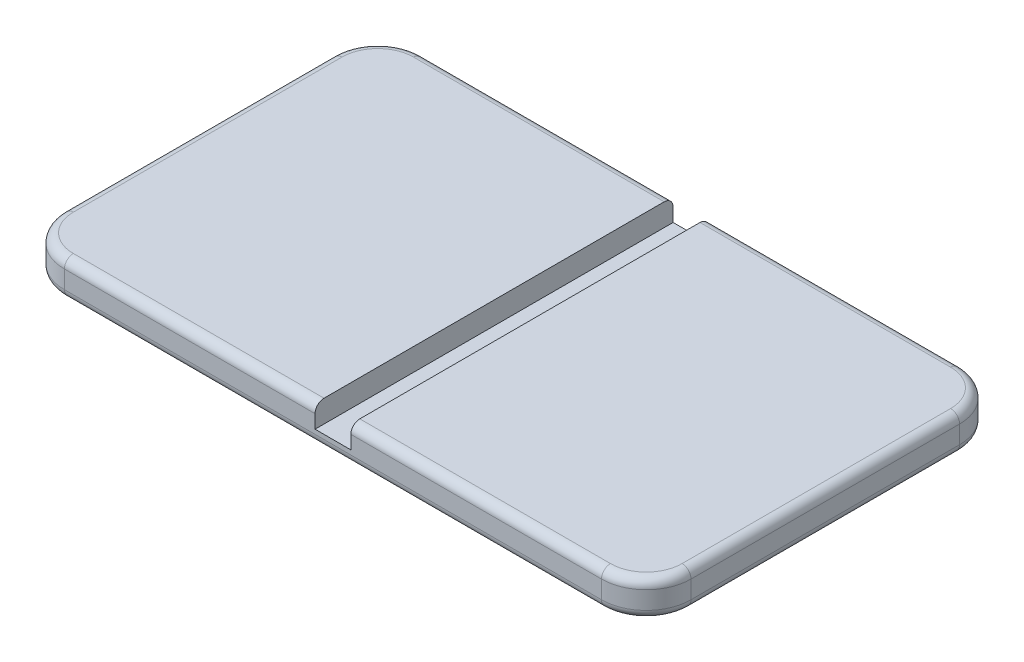
ISO-10303-21;
HEADER;
FILE_DESCRIPTION(('STEP AP214'),'2;1');
FILE_NAME('part.step','',(''),(''),'','','');
FILE_SCHEMA(('AUTOMOTIVE_DESIGN { 1 0 10303 214 1 1 1 1 }'));
ENDSEC;
DATA;
#1=APPLICATION_CONTEXT('core data for automotive mechanical design processes');
#2=APPLICATION_PROTOCOL_DEFINITION('international standard','automotive_design',2000,#1);
#3=PRODUCT_CONTEXT('',#1,'mechanical');
#4=PRODUCT('Part','Part','',(#3));
#5=PRODUCT_RELATED_PRODUCT_CATEGORY('part','',(#4));
#6=PRODUCT_DEFINITION_FORMATION('','',#4);
#7=PRODUCT_DEFINITION_CONTEXT('part definition',#1,'design');
#8=PRODUCT_DEFINITION('design','',#6,#7);
#9=PRODUCT_DEFINITION_SHAPE('','',#8);
#10=(LENGTH_UNIT() NAMED_UNIT(*) SI_UNIT(.MILLI.,.METRE.));
#11=(NAMED_UNIT(*) PLANE_ANGLE_UNIT() SI_UNIT($,.RADIAN.));
#12=(NAMED_UNIT(*) SI_UNIT($,.STERADIAN.) SOLID_ANGLE_UNIT());
#13=UNCERTAINTY_MEASURE_WITH_UNIT(LENGTH_MEASURE(1.E-05),#10,'distance_accuracy_value','');
#14=(GEOMETRIC_REPRESENTATION_CONTEXT(3) GLOBAL_UNCERTAINTY_ASSIGNED_CONTEXT((#13)) GLOBAL_UNIT_ASSIGNED_CONTEXT((#10,
#11,#12)) REPRESENTATION_CONTEXT('',''));
#15=CARTESIAN_POINT('',(0.,0.,0.));
#16=DIRECTION('',(0.,0.,1.));
#17=DIRECTION('',(1.,0.,0.));
#18=AXIS2_PLACEMENT_3D('',#15,#16,#17);
#19=CARTESIAN_POINT('',(0.,8.,0.));
#20=DIRECTION('',(0.,-1.,0.));
#21=DIRECTION('',(0.,0.,-1.));
#22=AXIS2_PLACEMENT_3D('',#19,#20,#21);
#23=PLANE('',#22);
#24=CARTESIAN_POINT('',(10.,8.,-10.));
#25=DIRECTION('',(0.,-1.,0.));
#26=DIRECTION('',(0.,0.,-1.));
#27=AXIS2_PLACEMENT_3D('',#24,#25,#26);
#28=CIRCLE('',#27,8.);
#29=CARTESIAN_POINT('',(2.,8.,-10.));
#30=VERTEX_POINT('',#29);
#31=CARTESIAN_POINT('',(10.,8.,-2.));
#32=VERTEX_POINT('',#31);
#33=EDGE_CURVE('E312',#30,#32,#28,.F.);
#34=ORIENTED_EDGE('',*,*,#33,.T.);
#35=DIRECTION('',(1.,0.,0.));
#36=VECTOR('',#35,1.);
#37=CARTESIAN_POINT('',(0.,8.,-2.));
#38=LINE('',#37,#36);
#39=CARTESIAN_POINT('',(66.,8.,-2.));
#40=VERTEX_POINT('',#39);
#41=EDGE_CURVE('E314',#32,#40,#38,.T.);
#42=ORIENTED_EDGE('',*,*,#41,.T.);
#43=DIRECTION('',(0.,0.,1.));
#44=VECTOR('',#43,1.);
#45=CARTESIAN_POINT('',(66.,8.,-80.001));
#46=LINE('',#45,#44);
#47=CARTESIAN_POINT('',(66.,8.,-78.));
#48=VERTEX_POINT('',#47);
#49=EDGE_CURVE('E211',#48,#40,#46,.T.);
#50=ORIENTED_EDGE('',*,*,#49,.F.);
#51=DIRECTION('',(-1.,0.,0.));
#52=VECTOR('',#51,1.);
#53=CARTESIAN_POINT('',(0.,8.,-78.));
#54=LINE('',#53,#52);
#55=CARTESIAN_POINT('',(10.,8.,-78.));
#56=VERTEX_POINT('',#55);
#57=EDGE_CURVE('E306',#48,#56,#54,.T.);
#58=ORIENTED_EDGE('',*,*,#57,.T.);
#59=CARTESIAN_POINT('',(10.,8.,-70.));
#60=DIRECTION('',(0.,-1.,0.));
#61=DIRECTION('',(0.,0.,-1.));
#62=AXIS2_PLACEMENT_3D('',#59,#60,#61);
#63=CIRCLE('',#62,8.);
#64=CARTESIAN_POINT('',(2.,8.,-70.));
#65=VERTEX_POINT('',#64);
#66=EDGE_CURVE('E308',#56,#65,#63,.F.);
#67=ORIENTED_EDGE('',*,*,#66,.T.);
#68=DIRECTION('',(0.,0.,1.));
#69=VECTOR('',#68,1.);
#70=CARTESIAN_POINT('',(2.,8.,0.));
#71=LINE('',#70,#69);
#72=EDGE_CURVE('E310',#65,#30,#71,.T.);
#73=ORIENTED_EDGE('',*,*,#72,.T.);
#74=EDGE_LOOP('',(#34,#42,#50,#58,#67,#73));
#75=FACE_BOUND('',#74,.T.);
#76=ADVANCED_FACE('F35',(#75),#23,.F.);
#77=CARTESIAN_POINT('',(0.,8.,0.));
#78=DIRECTION('',(1.,0.,0.));
#79=DIRECTION('',(0.,0.,-1.));
#80=AXIS2_PLACEMENT_3D('',#77,#78,#79);
#81=PLANE('',#80);
#82=DIRECTION('',(0.,-1.,0.));
#83=VECTOR('',#82,1.);
#84=CARTESIAN_POINT('',(0.,8.,-70.));
#85=LINE('',#84,#83);
#86=CARTESIAN_POINT('',(0.,6.,-70.));
#87=VERTEX_POINT('',#86);
#88=CARTESIAN_POINT('',(0.,2.,-70.));
#89=VERTEX_POINT('',#88);
#90=EDGE_CURVE('E234',#87,#89,#85,.T.);
#91=ORIENTED_EDGE('',*,*,#90,.T.);
#92=DIRECTION('',(0.,0.,1.));
#93=VECTOR('',#92,1.);
#94=CARTESIAN_POINT('',(0.,2.,-10.));
#95=LINE('',#94,#93);
#96=CARTESIAN_POINT('',(0.,2.,-10.));
#97=VERTEX_POINT('',#96);
#98=EDGE_CURVE('E304',#89,#97,#95,.T.);
#99=ORIENTED_EDGE('',*,*,#98,.T.);
#100=DIRECTION('',(0.,-1.,0.));
#101=VECTOR('',#100,1.);
#102=CARTESIAN_POINT('',(0.,8.,-10.));
#103=LINE('',#102,#101);
#104=CARTESIAN_POINT('',(0.,6.,-10.));
#105=VERTEX_POINT('',#104);
#106=EDGE_CURVE('E210',#97,#105,#103,.F.);
#107=ORIENTED_EDGE('',*,*,#106,.T.);
#108=DIRECTION('',(0.,0.,1.));
#109=VECTOR('',#108,1.);
#110=CARTESIAN_POINT('',(0.,6.,0.));
#111=LINE('',#110,#109);
#112=EDGE_CURVE('E302',#105,#87,#111,.F.);
#113=ORIENTED_EDGE('',*,*,#112,.T.);
#114=EDGE_LOOP('',(#91,#99,#107,#113));
#115=FACE_BOUND('',#114,.T.);
#116=ADVANCED_FACE('F470',(#115),#81,.F.);
#117=CARTESIAN_POINT('',(0.,8.,0.));
#118=DIRECTION('',(0.,0.,-1.));
#119=DIRECTION('',(-1.,0.,0.));
#120=AXIS2_PLACEMENT_3D('',#117,#118,#119);
#121=PLANE('',#120);
#122=DIRECTION('',(0.,-1.,0.));
#123=VECTOR('',#122,1.);
#124=CARTESIAN_POINT('',(10.,8.,0.));
#125=LINE('',#124,#123);
#126=CARTESIAN_POINT('',(10.,6.,0.));
#127=VERTEX_POINT('',#126);
#128=CARTESIAN_POINT('',(10.,2.,0.));
#129=VERTEX_POINT('',#128);
#130=EDGE_CURVE('E247',#127,#129,#125,.T.);
#131=ORIENTED_EDGE('',*,*,#130,.T.);
#132=DIRECTION('',(1.,0.,0.));
#133=VECTOR('',#132,1.);
#134=CARTESIAN_POINT('',(130.,2.,0.));
#135=LINE('',#134,#133);
#136=CARTESIAN_POINT('',(130.,2.,0.));
#137=VERTEX_POINT('',#136);
#138=EDGE_CURVE('E279',#129,#137,#135,.T.);
#139=ORIENTED_EDGE('',*,*,#138,.T.);
#140=DIRECTION('',(0.,-1.,0.));
#141=VECTOR('',#140,1.);
#142=CARTESIAN_POINT('',(130.,8.,0.));
#143=LINE('',#142,#141);
#144=CARTESIAN_POINT('',(130.,6.,0.));
#145=VERTEX_POINT('',#144);
#146=EDGE_CURVE('E250',#137,#145,#143,.F.);
#147=ORIENTED_EDGE('',*,*,#146,.T.);
#148=DIRECTION('',(1.,0.,0.));
#149=VECTOR('',#148,1.);
#150=CARTESIAN_POINT('',(0.,6.,0.));
#151=LINE('',#150,#149);
#152=CARTESIAN_POINT('',(74.,6.,0.));
#153=VERTEX_POINT('',#152);
#154=EDGE_CURVE('E275',#145,#153,#151,.F.);
#155=ORIENTED_EDGE('',*,*,#154,.T.);
#156=DIRECTION('',(0.,1.,0.));
#157=VECTOR('',#156,1.);
#158=CARTESIAN_POINT('',(74.,8.,0.));
#159=LINE('',#158,#157);
#160=CARTESIAN_POINT('',(74.,3.,0.));
#161=VERTEX_POINT('',#160);
#162=EDGE_CURVE('E202',#161,#153,#159,.T.);
#163=ORIENTED_EDGE('',*,*,#162,.F.);
#164=DIRECTION('',(1.,0.,0.));
#165=VECTOR('',#164,1.);
#166=CARTESIAN_POINT('',(66.,3.,0.));
#167=LINE('',#166,#165);
#168=CARTESIAN_POINT('',(66.,3.,0.));
#169=VERTEX_POINT('',#168);
#170=EDGE_CURVE('E220',#169,#161,#167,.T.);
#171=ORIENTED_EDGE('',*,*,#170,.F.);
#172=DIRECTION('',(0.,-1.,0.));
#173=VECTOR('',#172,1.);
#174=CARTESIAN_POINT('',(66.,8.,0.));
#175=LINE('',#174,#173);
#176=CARTESIAN_POINT('',(66.,6.,0.));
#177=VERTEX_POINT('',#176);
#178=EDGE_CURVE('E197',#177,#169,#175,.T.);
#179=ORIENTED_EDGE('',*,*,#178,.F.);
#180=DIRECTION('',(1.,0.,0.));
#181=VECTOR('',#180,1.);
#182=CARTESIAN_POINT('',(0.,6.,0.));
#183=LINE('',#182,#181);
#184=EDGE_CURVE('E277',#177,#127,#183,.F.);
#185=ORIENTED_EDGE('',*,*,#184,.T.);
#186=EDGE_LOOP('',(#131,#139,#147,#155,#163,#171,#179,#185));
#187=FACE_BOUND('',#186,.T.);
#188=ADVANCED_FACE('F459',(#187),#121,.F.);
#189=CARTESIAN_POINT('',(140.,8.,0.));
#190=DIRECTION('',(-1.,0.,0.));
#191=DIRECTION('',(0.,0.,1.));
#192=AXIS2_PLACEMENT_3D('',#189,#190,#191);
#193=PLANE('',#192);
#194=DIRECTION('',(0.,-1.,0.));
#195=VECTOR('',#194,1.);
#196=CARTESIAN_POINT('',(140.,8.,-10.));
#197=LINE('',#196,#195);
#198=CARTESIAN_POINT('',(140.,6.,-10.));
#199=VERTEX_POINT('',#198);
#200=CARTESIAN_POINT('',(140.,2.,-10.));
#201=VERTEX_POINT('',#200);
#202=EDGE_CURVE('E241',#199,#201,#197,.T.);
#203=ORIENTED_EDGE('',*,*,#202,.T.);
#204=DIRECTION('',(0.,0.,-1.));
#205=VECTOR('',#204,1.);
#206=CARTESIAN_POINT('',(140.,2.,-70.));
#207=LINE('',#206,#205);
#208=CARTESIAN_POINT('',(140.,2.,-70.));
#209=VERTEX_POINT('',#208);
#210=EDGE_CURVE('E287',#201,#209,#207,.T.);
#211=ORIENTED_EDGE('',*,*,#210,.T.);
#212=DIRECTION('',(0.,-1.,0.));
#213=VECTOR('',#212,1.);
#214=CARTESIAN_POINT('',(140.,8.,-70.));
#215=LINE('',#214,#213);
#216=CARTESIAN_POINT('',(140.,6.,-70.));
#217=VERTEX_POINT('',#216);
#218=EDGE_CURVE('E244',#209,#217,#215,.F.);
#219=ORIENTED_EDGE('',*,*,#218,.T.);
#220=DIRECTION('',(0.,0.,-1.));
#221=VECTOR('',#220,1.);
#222=CARTESIAN_POINT('',(140.,6.,0.));
#223=LINE('',#222,#221);
#224=EDGE_CURVE('E285',#217,#199,#223,.F.);
#225=ORIENTED_EDGE('',*,*,#224,.T.);
#226=EDGE_LOOP('',(#203,#211,#219,#225));
#227=FACE_BOUND('',#226,.T.);
#228=ADVANCED_FACE('F395',(#227),#193,.F.);
#229=CARTESIAN_POINT('',(0.,8.,-80.));
#230=DIRECTION('',(0.,0.,1.));
#231=DIRECTION('',(1.,0.,0.));
#232=AXIS2_PLACEMENT_3D('',#229,#230,#231);
#233=PLANE('',#232);
#234=DIRECTION('',(0.,-1.,0.));
#235=VECTOR('',#234,1.);
#236=CARTESIAN_POINT('',(130.,8.,-80.));
#237=LINE('',#236,#235);
#238=CARTESIAN_POINT('',(130.,6.,-80.));
#239=VERTEX_POINT('',#238);
#240=CARTESIAN_POINT('',(130.,2.,-80.));
#241=VERTEX_POINT('',#240);
#242=EDGE_CURVE('E237',#239,#241,#237,.T.);
#243=ORIENTED_EDGE('',*,*,#242,.T.);
#244=DIRECTION('',(-1.,0.,0.));
#245=VECTOR('',#244,1.);
#246=CARTESIAN_POINT('',(10.,2.,-80.));
#247=LINE('',#246,#245);
#248=CARTESIAN_POINT('',(10.,2.,-80.));
#249=VERTEX_POINT('',#248);
#250=EDGE_CURVE('E296',#241,#249,#247,.T.);
#251=ORIENTED_EDGE('',*,*,#250,.T.);
#252=DIRECTION('',(0.,-1.,0.));
#253=VECTOR('',#252,1.);
#254=CARTESIAN_POINT('',(10.,8.,-80.));
#255=LINE('',#254,#253);
#256=CARTESIAN_POINT('',(10.,6.,-80.));
#257=VERTEX_POINT('',#256);
#258=EDGE_CURVE('E239',#249,#257,#255,.F.);
#259=ORIENTED_EDGE('',*,*,#258,.T.);
#260=DIRECTION('',(-1.,0.,0.));
#261=VECTOR('',#260,1.);
#262=CARTESIAN_POINT('',(0.,6.,-80.));
#263=LINE('',#262,#261);
#264=CARTESIAN_POINT('',(66.,6.,-80.));
#265=VERTEX_POINT('',#264);
#266=EDGE_CURVE('E217',#257,#265,#263,.F.);
#267=ORIENTED_EDGE('',*,*,#266,.T.);
#268=DIRECTION('',(0.,1.,0.));
#269=VECTOR('',#268,1.);
#270=CARTESIAN_POINT('',(66.,8.,-80.));
#271=LINE('',#270,#269);
#272=CARTESIAN_POINT('',(66.,3.,-80.));
#273=VERTEX_POINT('',#272);
#274=EDGE_CURVE('E194',#273,#265,#271,.T.);
#275=ORIENTED_EDGE('',*,*,#274,.F.);
#276=DIRECTION('',(-1.,0.,0.));
#277=VECTOR('',#276,1.);
#278=CARTESIAN_POINT('',(66.,3.,-80.));
#279=LINE('',#278,#277);
#280=CARTESIAN_POINT('',(74.,3.,-80.));
#281=VERTEX_POINT('',#280);
#282=EDGE_CURVE('E206',#281,#273,#279,.T.);
#283=ORIENTED_EDGE('',*,*,#282,.F.);
#284=DIRECTION('',(0.,-1.,0.));
#285=VECTOR('',#284,1.);
#286=CARTESIAN_POINT('',(74.,8.,-80.));
#287=LINE('',#286,#285);
#288=CARTESIAN_POINT('',(74.,6.,-80.));
#289=VERTEX_POINT('',#288);
#290=EDGE_CURVE('E218',#289,#281,#287,.T.);
#291=ORIENTED_EDGE('',*,*,#290,.F.);
#292=DIRECTION('',(-1.,0.,0.));
#293=VECTOR('',#292,1.);
#294=CARTESIAN_POINT('',(0.,6.,-80.));
#295=LINE('',#294,#293);
#296=EDGE_CURVE('E293',#289,#239,#295,.F.);
#297=ORIENTED_EDGE('',*,*,#296,.T.);
#298=EDGE_LOOP('',(#243,#251,#259,#267,#275,#283,#291,#297));
#299=FACE_BOUND('',#298,.T.);
#300=ADVANCED_FACE('F214',(#299),#233,.F.);
#301=DIRECTION('',(0.,0.,1.));
#302=VECTOR('',#301,1.);
#303=CARTESIAN_POINT('',(74.,8.,-80.001));
#304=LINE('',#303,#302);
#305=CARTESIAN_POINT('',(74.,8.,-78.));
#306=VERTEX_POINT('',#305);
#307=CARTESIAN_POINT('',(74.,8.,-2.));
#308=VERTEX_POINT('',#307);
#309=EDGE_CURVE('E229',#306,#308,#304,.T.);
#310=ORIENTED_EDGE('',*,*,#309,.T.);
#311=DIRECTION('',(1.,0.,0.));
#312=VECTOR('',#311,1.);
#313=CARTESIAN_POINT('',(0.,8.,-2.));
#314=LINE('',#313,#312);
#315=CARTESIAN_POINT('',(130.,8.,-2.));
#316=VERTEX_POINT('',#315);
#317=EDGE_CURVE('E52',#308,#316,#314,.T.);
#318=ORIENTED_EDGE('',*,*,#317,.T.);
#319=CARTESIAN_POINT('',(130.,8.,-10.));
#320=DIRECTION('',(0.,-1.,0.));
#321=DIRECTION('',(0.,0.,-1.));
#322=AXIS2_PLACEMENT_3D('',#319,#320,#321);
#323=CIRCLE('',#322,8.);
#324=CARTESIAN_POINT('',(138.,8.,-10.));
#325=VERTEX_POINT('',#324);
#326=EDGE_CURVE('E327',#316,#325,#323,.F.);
#327=ORIENTED_EDGE('',*,*,#326,.T.);
#328=DIRECTION('',(0.,0.,-1.));
#329=VECTOR('',#328,1.);
#330=CARTESIAN_POINT('',(138.,8.,0.));
#331=LINE('',#330,#329);
#332=CARTESIAN_POINT('',(138.,8.,-70.));
#333=VERTEX_POINT('',#332);
#334=EDGE_CURVE('E325',#325,#333,#331,.T.);
#335=ORIENTED_EDGE('',*,*,#334,.T.);
#336=CARTESIAN_POINT('',(130.,8.,-70.));
#337=DIRECTION('',(0.,-1.,0.));
#338=DIRECTION('',(0.,0.,-1.));
#339=AXIS2_PLACEMENT_3D('',#336,#337,#338);
#340=CIRCLE('',#339,8.);
#341=CARTESIAN_POINT('',(130.,8.,-78.));
#342=VERTEX_POINT('',#341);
#343=EDGE_CURVE('E323',#333,#342,#340,.F.);
#344=ORIENTED_EDGE('',*,*,#343,.T.);
#345=DIRECTION('',(-1.,0.,0.));
#346=VECTOR('',#345,1.);
#347=CARTESIAN_POINT('',(0.,8.,-78.));
#348=LINE('',#347,#346);
#349=EDGE_CURVE('E321',#342,#306,#348,.T.);
#350=ORIENTED_EDGE('',*,*,#349,.T.);
#351=EDGE_LOOP('',(#310,#318,#327,#335,#344,#350));
#352=FACE_BOUND('',#351,.T.);
#353=ADVANCED_FACE('F383',(#352),#23,.F.);
#354=CARTESIAN_POINT('',(0.,0.,0.));
#355=DIRECTION('',(0.,-1.,0.));
#356=DIRECTION('',(0.,0.,-1.));
#357=AXIS2_PLACEMENT_3D('',#354,#355,#356);
#358=PLANE('',#357);
#359=DIRECTION('',(1.,0.,0.));
#360=VECTOR('',#359,1.);
#361=CARTESIAN_POINT('',(10.,0.,-2.));
#362=LINE('',#361,#360);
#363=CARTESIAN_POINT('',(130.,0.,-2.));
#364=VERTEX_POINT('',#363);
#365=CARTESIAN_POINT('',(10.,0.,-2.));
#366=VERTEX_POINT('',#365);
#367=EDGE_CURVE('E265',#364,#366,#362,.F.);
#368=ORIENTED_EDGE('',*,*,#367,.T.);
#369=CARTESIAN_POINT('',(10.,0.,-10.));
#370=DIRECTION('',(0.,-1.,0.));
#371=DIRECTION('',(0.,0.,-1.));
#372=AXIS2_PLACEMENT_3D('',#369,#370,#371);
#373=CIRCLE('',#372,8.);
#374=CARTESIAN_POINT('',(2.,0.,-10.));
#375=VERTEX_POINT('',#374);
#376=EDGE_CURVE('E267',#366,#375,#373,.T.);
#377=ORIENTED_EDGE('',*,*,#376,.T.);
#378=DIRECTION('',(0.,0.,1.));
#379=VECTOR('',#378,1.);
#380=CARTESIAN_POINT('',(2.,0.,-70.));
#381=LINE('',#380,#379);
#382=CARTESIAN_POINT('',(2.,0.,-70.));
#383=VERTEX_POINT('',#382);
#384=EDGE_CURVE('E253',#375,#383,#381,.F.);
#385=ORIENTED_EDGE('',*,*,#384,.T.);
#386=CARTESIAN_POINT('',(10.,0.,-70.));
#387=DIRECTION('',(0.,-1.,0.));
#388=DIRECTION('',(0.,0.,-1.));
#389=AXIS2_PLACEMENT_3D('',#386,#387,#388);
#390=CIRCLE('',#389,8.);
#391=CARTESIAN_POINT('',(10.,0.,-78.));
#392=VERTEX_POINT('',#391);
#393=EDGE_CURVE('E255',#383,#392,#390,.T.);
#394=ORIENTED_EDGE('',*,*,#393,.T.);
#395=DIRECTION('',(-1.,0.,0.));
#396=VECTOR('',#395,1.);
#397=CARTESIAN_POINT('',(130.,0.,-78.));
#398=LINE('',#397,#396);
#399=CARTESIAN_POINT('',(130.,0.,-78.));
#400=VERTEX_POINT('',#399);
#401=EDGE_CURVE('E257',#392,#400,#398,.F.);
#402=ORIENTED_EDGE('',*,*,#401,.T.);
#403=CARTESIAN_POINT('',(130.,0.,-70.));
#404=DIRECTION('',(0.,-1.,0.));
#405=DIRECTION('',(0.,0.,-1.));
#406=AXIS2_PLACEMENT_3D('',#403,#404,#405);
#407=CIRCLE('',#406,8.);
#408=CARTESIAN_POINT('',(138.,0.,-70.));
#409=VERTEX_POINT('',#408);
#410=EDGE_CURVE('E259',#400,#409,#407,.T.);
#411=ORIENTED_EDGE('',*,*,#410,.T.);
#412=DIRECTION('',(0.,0.,-1.));
#413=VECTOR('',#412,1.);
#414=CARTESIAN_POINT('',(138.,0.,-10.));
#415=LINE('',#414,#413);
#416=CARTESIAN_POINT('',(138.,0.,-10.));
#417=VERTEX_POINT('',#416);
#418=EDGE_CURVE('E261',#409,#417,#415,.F.);
#419=ORIENTED_EDGE('',*,*,#418,.T.);
#420=CARTESIAN_POINT('',(130.,0.,-10.));
#421=DIRECTION('',(0.,-1.,0.));
#422=DIRECTION('',(0.,0.,-1.));
#423=AXIS2_PLACEMENT_3D('',#420,#421,#422);
#424=CIRCLE('',#423,8.);
#425=EDGE_CURVE('E263',#417,#364,#424,.T.);
#426=ORIENTED_EDGE('',*,*,#425,.T.);
#427=EDGE_LOOP('',(#368,#377,#385,#394,#402,#411,#419,#426));
#428=FACE_BOUND('',#427,.T.);
#429=ADVANCED_FACE('F414',(#428),#358,.T.);
#430=CARTESIAN_POINT('',(66.,8.,-80.001));
#431=DIRECTION('',(-1.,0.,0.));
#432=DIRECTION('',(0.,0.,1.));
#433=AXIS2_PLACEMENT_3D('',#430,#431,#432);
#434=PLANE('',#433);
#435=ORIENTED_EDGE('',*,*,#49,.T.);
#436=CARTESIAN_POINT('',(66.,6.,-2.));
#437=DIRECTION('',(-1.,0.,0.));
#438=DIRECTION('',(0.,0.,1.));
#439=AXIS2_PLACEMENT_3D('',#436,#437,#438);
#440=CIRCLE('',#439,2.);
#441=EDGE_CURVE('E319',#40,#177,#440,.F.);
#442=ORIENTED_EDGE('',*,*,#441,.T.);
#443=ORIENTED_EDGE('',*,*,#178,.T.);
#444=DIRECTION('',(0.,0.,1.));
#445=VECTOR('',#444,1.);
#446=CARTESIAN_POINT('',(66.,3.,-80.001));
#447=LINE('',#446,#445);
#448=EDGE_CURVE('E189',#273,#169,#447,.T.);
#449=ORIENTED_EDGE('',*,*,#448,.F.);
#450=ORIENTED_EDGE('',*,*,#274,.T.);
#451=CARTESIAN_POINT('',(66.,6.,-78.));
#452=DIRECTION('',(-1.,0.,0.));
#453=DIRECTION('',(0.,0.,1.));
#454=AXIS2_PLACEMENT_3D('',#451,#452,#453);
#455=CIRCLE('',#454,2.);
#456=EDGE_CURVE('E317',#265,#48,#455,.F.);
#457=ORIENTED_EDGE('',*,*,#456,.T.);
#458=EDGE_LOOP('',(#435,#442,#443,#449,#450,#457));
#459=FACE_BOUND('',#458,.T.);
#460=ADVANCED_FACE('F192',(#459),#434,.F.);
#461=CARTESIAN_POINT('',(74.,8.,-80.001));
#462=DIRECTION('',(1.,0.,0.));
#463=DIRECTION('',(0.,0.,-1.));
#464=AXIS2_PLACEMENT_3D('',#461,#462,#463);
#465=PLANE('',#464);
#466=ORIENTED_EDGE('',*,*,#162,.T.);
#467=CARTESIAN_POINT('',(74.,6.,-2.));
#468=DIRECTION('',(1.,0.,0.));
#469=DIRECTION('',(0.,0.,-1.));
#470=AXIS2_PLACEMENT_3D('',#467,#468,#469);
#471=CIRCLE('',#470,2.);
#472=EDGE_CURVE('E11',#153,#308,#471,.F.);
#473=ORIENTED_EDGE('',*,*,#472,.T.);
#474=ORIENTED_EDGE('',*,*,#309,.F.);
#475=CARTESIAN_POINT('',(74.,6.,-78.));
#476=DIRECTION('',(1.,0.,0.));
#477=DIRECTION('',(0.,0.,-1.));
#478=AXIS2_PLACEMENT_3D('',#475,#476,#477);
#479=CIRCLE('',#478,2.);
#480=EDGE_CURVE('E44',#306,#289,#479,.F.);
#481=ORIENTED_EDGE('',*,*,#480,.T.);
#482=ORIENTED_EDGE('',*,*,#290,.T.);
#483=DIRECTION('',(0.,0.,1.));
#484=VECTOR('',#483,1.);
#485=CARTESIAN_POINT('',(74.,3.,-80.001));
#486=LINE('',#485,#484);
#487=EDGE_CURVE('E201',#281,#161,#486,.T.);
#488=ORIENTED_EDGE('',*,*,#487,.T.);
#489=EDGE_LOOP('',(#466,#473,#474,#481,#482,#488));
#490=FACE_BOUND('',#489,.T.);
#491=ADVANCED_FACE('F385',(#490),#465,.F.);
#492=CARTESIAN_POINT('',(66.,3.,-80.001));
#493=DIRECTION('',(0.,-1.,0.));
#494=DIRECTION('',(1.,0.,0.));
#495=AXIS2_PLACEMENT_3D('',#492,#493,#494);
#496=PLANE('',#495);
#497=ORIENTED_EDGE('',*,*,#282,.T.);
#498=ORIENTED_EDGE('',*,*,#448,.T.);
#499=ORIENTED_EDGE('',*,*,#170,.T.);
#500=ORIENTED_EDGE('',*,*,#487,.F.);
#501=EDGE_LOOP('',(#497,#498,#499,#500));
#502=FACE_BOUND('',#501,.T.);
#503=ADVANCED_FACE('F207',(#502),#496,.F.);
#504=CARTESIAN_POINT('',(10.,8.,-70.));
#505=DIRECTION('',(0.,-1.,0.));
#506=DIRECTION('',(0.,0.,-1.));
#507=AXIS2_PLACEMENT_3D('',#504,#505,#506);
#508=CYLINDRICAL_SURFACE('',#507,10.);
#509=ORIENTED_EDGE('',*,*,#258,.F.);
#510=CARTESIAN_POINT('',(10.,2.,-70.));
#511=DIRECTION('',(0.,-1.,0.));
#512=DIRECTION('',(0.,0.,-1.));
#513=AXIS2_PLACEMENT_3D('',#510,#511,#512);
#514=CIRCLE('',#513,10.);
#515=EDGE_CURVE('E300',#249,#89,#514,.F.);
#516=ORIENTED_EDGE('',*,*,#515,.T.);
#517=ORIENTED_EDGE('',*,*,#90,.F.);
#518=CARTESIAN_POINT('',(10.,6.,-70.));
#519=DIRECTION('',(0.,-1.,0.));
#520=DIRECTION('',(0.,0.,-1.));
#521=AXIS2_PLACEMENT_3D('',#518,#519,#520);
#522=CIRCLE('',#521,10.);
#523=EDGE_CURVE('E298',#87,#257,#522,.T.);
#524=ORIENTED_EDGE('',*,*,#523,.T.);
#525=EDGE_LOOP('',(#509,#516,#517,#524));
#526=FACE_BOUND('',#525,.T.);
#527=ADVANCED_FACE('F435',(#526),#508,.T.);
#528=CARTESIAN_POINT('',(130.,8.,-70.));
#529=DIRECTION('',(0.,-1.,0.));
#530=DIRECTION('',(0.,0.,-1.));
#531=AXIS2_PLACEMENT_3D('',#528,#529,#530);
#532=CYLINDRICAL_SURFACE('',#531,10.);
#533=ORIENTED_EDGE('',*,*,#218,.F.);
#534=CARTESIAN_POINT('',(130.,2.,-70.));
#535=DIRECTION('',(0.,-1.,0.));
#536=DIRECTION('',(0.,0.,-1.));
#537=AXIS2_PLACEMENT_3D('',#534,#535,#536);
#538=CIRCLE('',#537,10.);
#539=EDGE_CURVE('E291',#209,#241,#538,.F.);
#540=ORIENTED_EDGE('',*,*,#539,.T.);
#541=ORIENTED_EDGE('',*,*,#242,.F.);
#542=CARTESIAN_POINT('',(130.,6.,-70.));
#543=DIRECTION('',(0.,-1.,0.));
#544=DIRECTION('',(0.,0.,-1.));
#545=AXIS2_PLACEMENT_3D('',#542,#543,#544);
#546=CIRCLE('',#545,10.);
#547=EDGE_CURVE('E289',#239,#217,#546,.T.);
#548=ORIENTED_EDGE('',*,*,#547,.T.);
#549=EDGE_LOOP('',(#533,#540,#541,#548));
#550=FACE_BOUND('',#549,.T.);
#551=ADVANCED_FACE('F422',(#550),#532,.T.);
#552=CARTESIAN_POINT('',(130.,8.,-10.));
#553=DIRECTION('',(0.,-1.,0.));
#554=DIRECTION('',(0.,0.,-1.));
#555=AXIS2_PLACEMENT_3D('',#552,#553,#554);
#556=CYLINDRICAL_SURFACE('',#555,10.);
#557=ORIENTED_EDGE('',*,*,#146,.F.);
#558=CARTESIAN_POINT('',(130.,2.,-10.));
#559=DIRECTION('',(0.,-1.,0.));
#560=DIRECTION('',(0.,0.,-1.));
#561=AXIS2_PLACEMENT_3D('',#558,#559,#560);
#562=CIRCLE('',#561,10.);
#563=EDGE_CURVE('E283',#137,#201,#562,.F.);
#564=ORIENTED_EDGE('',*,*,#563,.T.);
#565=ORIENTED_EDGE('',*,*,#202,.F.);
#566=CARTESIAN_POINT('',(130.,6.,-10.));
#567=DIRECTION('',(0.,-1.,0.));
#568=DIRECTION('',(0.,0.,-1.));
#569=AXIS2_PLACEMENT_3D('',#566,#567,#568);
#570=CIRCLE('',#569,10.);
#571=EDGE_CURVE('E281',#199,#145,#570,.T.);
#572=ORIENTED_EDGE('',*,*,#571,.T.);
#573=EDGE_LOOP('',(#557,#564,#565,#572));
#574=FACE_BOUND('',#573,.T.);
#575=ADVANCED_FACE('F400',(#574),#556,.T.);
#576=CARTESIAN_POINT('',(10.,8.,-10.));
#577=DIRECTION('',(0.,-1.,0.));
#578=DIRECTION('',(0.,0.,-1.));
#579=AXIS2_PLACEMENT_3D('',#576,#577,#578);
#580=CYLINDRICAL_SURFACE('',#579,10.);
#581=ORIENTED_EDGE('',*,*,#106,.F.);
#582=CARTESIAN_POINT('',(10.,2.,-10.));
#583=DIRECTION('',(0.,-1.,0.));
#584=DIRECTION('',(0.,0.,-1.));
#585=AXIS2_PLACEMENT_3D('',#582,#583,#584);
#586=CIRCLE('',#585,10.);
#587=EDGE_CURVE('E272',#97,#129,#586,.F.);
#588=ORIENTED_EDGE('',*,*,#587,.T.);
#589=ORIENTED_EDGE('',*,*,#130,.F.);
#590=CARTESIAN_POINT('',(10.,6.,-10.));
#591=DIRECTION('',(0.,-1.,0.));
#592=DIRECTION('',(0.,0.,-1.));
#593=AXIS2_PLACEMENT_3D('',#590,#591,#592);
#594=CIRCLE('',#593,10.);
#595=EDGE_CURVE('E270',#127,#105,#594,.T.);
#596=ORIENTED_EDGE('',*,*,#595,.T.);
#597=EDGE_LOOP('',(#581,#588,#589,#596));
#598=FACE_BOUND('',#597,.T.);
#599=ADVANCED_FACE('F467',(#598),#580,.T.);
#600=CARTESIAN_POINT('',(130.,2.,-70.));
#601=DIRECTION('',(0.,-1.,0.));
#602=DIRECTION('',(0.,0.,-1.));
#603=AXIS2_PLACEMENT_3D('',#600,#601,#602);
#604=TOROIDAL_SURFACE('',#603,8.,2.);
#605=CARTESIAN_POINT('',(130.,2.,-78.));
#606=DIRECTION('',(-1.,0.,0.));
#607=DIRECTION('',(0.,0.,1.));
#608=AXIS2_PLACEMENT_3D('',#605,#606,#607);
#609=CIRCLE('',#608,2.);
#610=EDGE_CURVE('E348',#241,#400,#609,.T.);
#611=ORIENTED_EDGE('',*,*,#610,.F.);
#612=ORIENTED_EDGE('',*,*,#539,.F.);
#613=CARTESIAN_POINT('',(138.,2.,-70.));
#614=DIRECTION('',(0.,0.,1.));
#615=DIRECTION('',(1.,0.,0.));
#616=AXIS2_PLACEMENT_3D('',#613,#614,#615);
#617=CIRCLE('',#616,2.);
#618=EDGE_CURVE('E222',#409,#209,#617,.T.);
#619=ORIENTED_EDGE('',*,*,#618,.F.);
#620=ORIENTED_EDGE('',*,*,#410,.F.);
#621=EDGE_LOOP('',(#611,#612,#619,#620));
#622=FACE_BOUND('',#621,.T.);
#623=ADVANCED_FACE('F426',(#622),#604,.T.);
#624=CARTESIAN_POINT('',(138.,2.,0.));
#625=DIRECTION('',(0.,0.,1.));
#626=DIRECTION('',(1.,0.,0.));
#627=AXIS2_PLACEMENT_3D('',#624,#625,#626);
#628=CYLINDRICAL_SURFACE('',#627,2.);
#629=ORIENTED_EDGE('',*,*,#618,.T.);
#630=ORIENTED_EDGE('',*,*,#210,.F.);
#631=CARTESIAN_POINT('',(138.,2.,-10.));
#632=DIRECTION('',(0.,0.,1.));
#633=DIRECTION('',(1.,0.,0.));
#634=AXIS2_PLACEMENT_3D('',#631,#632,#633);
#635=CIRCLE('',#634,2.);
#636=EDGE_CURVE('E345',#417,#201,#635,.T.);
#637=ORIENTED_EDGE('',*,*,#636,.F.);
#638=ORIENTED_EDGE('',*,*,#418,.F.);
#639=EDGE_LOOP('',(#629,#630,#637,#638));
#640=FACE_BOUND('',#639,.T.);
#641=ADVANCED_FACE('F419',(#640),#628,.T.);
#642=CARTESIAN_POINT('',(0.,2.,-78.));
#643=DIRECTION('',(1.,0.,0.));
#644=DIRECTION('',(0.,0.,-1.));
#645=AXIS2_PLACEMENT_3D('',#642,#643,#644);
#646=CYLINDRICAL_SURFACE('',#645,2.);
#647=ORIENTED_EDGE('',*,*,#610,.T.);
#648=ORIENTED_EDGE('',*,*,#401,.F.);
#649=CARTESIAN_POINT('',(10.,2.,-78.));
#650=DIRECTION('',(-1.,0.,0.));
#651=DIRECTION('',(0.,0.,1.));
#652=AXIS2_PLACEMENT_3D('',#649,#650,#651);
#653=CIRCLE('',#652,2.);
#654=EDGE_CURVE('E342',#249,#392,#653,.T.);
#655=ORIENTED_EDGE('',*,*,#654,.F.);
#656=ORIENTED_EDGE('',*,*,#250,.F.);
#657=EDGE_LOOP('',(#647,#648,#655,#656));
#658=FACE_BOUND('',#657,.T.);
#659=ADVANCED_FACE('F431',(#658),#646,.T.);
#660=CARTESIAN_POINT('',(130.,2.,-10.));
#661=DIRECTION('',(0.,-1.,0.));
#662=DIRECTION('',(0.,0.,-1.));
#663=AXIS2_PLACEMENT_3D('',#660,#661,#662);
#664=TOROIDAL_SURFACE('',#663,8.,2.);
#665=ORIENTED_EDGE('',*,*,#636,.T.);
#666=ORIENTED_EDGE('',*,*,#563,.F.);
#667=CARTESIAN_POINT('',(130.,2.,-2.));
#668=DIRECTION('',(-1.,0.,0.));
#669=DIRECTION('',(0.,0.,1.));
#670=AXIS2_PLACEMENT_3D('',#667,#668,#669);
#671=CIRCLE('',#670,2.);
#672=EDGE_CURVE('E339',#364,#137,#671,.T.);
#673=ORIENTED_EDGE('',*,*,#672,.F.);
#674=ORIENTED_EDGE('',*,*,#425,.F.);
#675=EDGE_LOOP('',(#665,#666,#673,#674));
#676=FACE_BOUND('',#675,.T.);
#677=ADVANCED_FACE('F404',(#676),#664,.T.);
#678=CARTESIAN_POINT('',(10.,2.,-70.));
#679=DIRECTION('',(0.,-1.,0.));
#680=DIRECTION('',(0.,0.,-1.));
#681=AXIS2_PLACEMENT_3D('',#678,#679,#680);
#682=TOROIDAL_SURFACE('',#681,8.,2.);
#683=ORIENTED_EDGE('',*,*,#654,.T.);
#684=ORIENTED_EDGE('',*,*,#393,.F.);
#685=CARTESIAN_POINT('',(2.,2.,-70.));
#686=DIRECTION('',(0.,0.,1.));
#687=DIRECTION('',(1.,0.,0.));
#688=AXIS2_PLACEMENT_3D('',#685,#686,#687);
#689=CIRCLE('',#688,2.);
#690=EDGE_CURVE('E336',#89,#383,#689,.T.);
#691=ORIENTED_EDGE('',*,*,#690,.F.);
#692=ORIENTED_EDGE('',*,*,#515,.F.);
#693=EDGE_LOOP('',(#683,#684,#691,#692));
#694=FACE_BOUND('',#693,.T.);
#695=ADVANCED_FACE('F583',(#694),#682,.T.);
#696=CARTESIAN_POINT('',(0.,2.,-2.));
#697=DIRECTION('',(-1.,0.,0.));
#698=DIRECTION('',(0.,0.,1.));
#699=AXIS2_PLACEMENT_3D('',#696,#697,#698);
#700=CYLINDRICAL_SURFACE('',#699,2.);
#701=ORIENTED_EDGE('',*,*,#672,.T.);
#702=ORIENTED_EDGE('',*,*,#138,.F.);
#703=CARTESIAN_POINT('',(10.,2.,-2.));
#704=DIRECTION('',(-1.,0.,0.));
#705=DIRECTION('',(0.,0.,1.));
#706=AXIS2_PLACEMENT_3D('',#703,#704,#705);
#707=CIRCLE('',#706,2.);
#708=EDGE_CURVE('E333',#366,#129,#707,.T.);
#709=ORIENTED_EDGE('',*,*,#708,.F.);
#710=ORIENTED_EDGE('',*,*,#367,.F.);
#711=EDGE_LOOP('',(#701,#702,#709,#710));
#712=FACE_BOUND('',#711,.T.);
#713=ADVANCED_FACE('F410',(#712),#700,.T.);
#714=CARTESIAN_POINT('',(2.,2.,0.));
#715=DIRECTION('',(0.,0.,-1.));
#716=DIRECTION('',(-1.,0.,0.));
#717=AXIS2_PLACEMENT_3D('',#714,#715,#716);
#718=CYLINDRICAL_SURFACE('',#717,2.);
#719=ORIENTED_EDGE('',*,*,#690,.T.);
#720=ORIENTED_EDGE('',*,*,#384,.F.);
#721=CARTESIAN_POINT('',(2.,2.,-10.));
#722=DIRECTION('',(0.,0.,1.));
#723=DIRECTION('',(1.,0.,0.));
#724=AXIS2_PLACEMENT_3D('',#721,#722,#723);
#725=CIRCLE('',#724,2.);
#726=EDGE_CURVE('E331',#97,#375,#725,.T.);
#727=ORIENTED_EDGE('',*,*,#726,.F.);
#728=ORIENTED_EDGE('',*,*,#98,.F.);
#729=EDGE_LOOP('',(#719,#720,#727,#728));
#730=FACE_BOUND('',#729,.T.);
#731=ADVANCED_FACE('F475',(#730),#718,.T.);
#732=CARTESIAN_POINT('',(10.,2.,-10.));
#733=DIRECTION('',(0.,-1.,0.));
#734=DIRECTION('',(0.,0.,-1.));
#735=AXIS2_PLACEMENT_3D('',#732,#733,#734);
#736=TOROIDAL_SURFACE('',#735,8.,2.);
#737=ORIENTED_EDGE('',*,*,#708,.T.);
#738=ORIENTED_EDGE('',*,*,#587,.F.);
#739=ORIENTED_EDGE('',*,*,#726,.T.);
#740=ORIENTED_EDGE('',*,*,#376,.F.);
#741=EDGE_LOOP('',(#737,#738,#739,#740));
#742=FACE_BOUND('',#741,.T.);
#743=ADVANCED_FACE('F478',(#742),#736,.T.);
#744=CARTESIAN_POINT('',(0.,6.,-78.));
#745=DIRECTION('',(-1.,0.,0.));
#746=DIRECTION('',(0.,0.,1.));
#747=AXIS2_PLACEMENT_3D('',#744,#745,#746);
#748=CYLINDRICAL_SURFACE('',#747,2.);
#749=ORIENTED_EDGE('',*,*,#456,.F.);
#750=ORIENTED_EDGE('',*,*,#266,.F.);
#751=CARTESIAN_POINT('',(10.,6.,-78.));
#752=DIRECTION('',(-1.,0.,0.));
#753=DIRECTION('',(0.,0.,1.));
#754=AXIS2_PLACEMENT_3D('',#751,#752,#753);
#755=CIRCLE('',#754,2.);
#756=EDGE_CURVE('E334',#56,#257,#755,.T.);
#757=ORIENTED_EDGE('',*,*,#756,.F.);
#758=ORIENTED_EDGE('',*,*,#57,.F.);
#759=EDGE_LOOP('',(#749,#750,#757,#758));
#760=FACE_BOUND('',#759,.T.);
#761=ADVANCED_FACE('F454',(#760),#748,.T.);
#762=CARTESIAN_POINT('',(10.,6.,-70.));
#763=DIRECTION('',(0.,-1.,0.));
#764=DIRECTION('',(0.,0.,-1.));
#765=AXIS2_PLACEMENT_3D('',#762,#763,#764);
#766=TOROIDAL_SURFACE('',#765,8.,2.);
#767=ORIENTED_EDGE('',*,*,#756,.T.);
#768=ORIENTED_EDGE('',*,*,#523,.F.);
#769=CARTESIAN_POINT('',(2.,6.,-70.));
#770=DIRECTION('',(0.,0.,1.));
#771=DIRECTION('',(1.,0.,0.));
#772=AXIS2_PLACEMENT_3D('',#769,#770,#771);
#773=CIRCLE('',#772,2.);
#774=EDGE_CURVE('E359',#65,#87,#773,.T.);
#775=ORIENTED_EDGE('',*,*,#774,.F.);
#776=ORIENTED_EDGE('',*,*,#66,.F.);
#777=EDGE_LOOP('',(#767,#768,#775,#776));
#778=FACE_BOUND('',#777,.T.);
#779=ADVANCED_FACE('F440',(#778),#766,.T.);
#780=CARTESIAN_POINT('',(2.,6.,0.));
#781=DIRECTION('',(0.,0.,1.));
#782=DIRECTION('',(1.,0.,0.));
#783=AXIS2_PLACEMENT_3D('',#780,#781,#782);
#784=CYLINDRICAL_SURFACE('',#783,2.);
#785=ORIENTED_EDGE('',*,*,#774,.T.);
#786=ORIENTED_EDGE('',*,*,#112,.F.);
#787=CARTESIAN_POINT('',(2.,6.,-10.));
#788=DIRECTION('',(0.,0.,1.));
#789=DIRECTION('',(1.,0.,0.));
#790=AXIS2_PLACEMENT_3D('',#787,#788,#789);
#791=CIRCLE('',#790,2.);
#792=EDGE_CURVE('E356',#30,#105,#791,.T.);
#793=ORIENTED_EDGE('',*,*,#792,.F.);
#794=ORIENTED_EDGE('',*,*,#72,.F.);
#795=EDGE_LOOP('',(#785,#786,#793,#794));
#796=FACE_BOUND('',#795,.T.);
#797=ADVANCED_FACE('F446',(#796),#784,.T.);
#798=CARTESIAN_POINT('',(10.,6.,-10.));
#799=DIRECTION('',(0.,-1.,0.));
#800=DIRECTION('',(0.,0.,-1.));
#801=AXIS2_PLACEMENT_3D('',#798,#799,#800);
#802=TOROIDAL_SURFACE('',#801,8.,2.);
#803=ORIENTED_EDGE('',*,*,#792,.T.);
#804=ORIENTED_EDGE('',*,*,#595,.F.);
#805=CARTESIAN_POINT('',(10.,6.,-2.));
#806=DIRECTION('',(1.,0.,0.));
#807=DIRECTION('',(0.,0.,-1.));
#808=AXIS2_PLACEMENT_3D('',#805,#806,#807);
#809=CIRCLE('',#808,2.);
#810=EDGE_CURVE('E353',#32,#127,#809,.T.);
#811=ORIENTED_EDGE('',*,*,#810,.F.);
#812=ORIENTED_EDGE('',*,*,#33,.F.);
#813=EDGE_LOOP('',(#803,#804,#811,#812));
#814=FACE_BOUND('',#813,.T.);
#815=ADVANCED_FACE('F464',(#814),#802,.T.);
#816=CARTESIAN_POINT('',(0.,6.,-2.));
#817=DIRECTION('',(1.,0.,0.));
#818=DIRECTION('',(0.,0.,-1.));
#819=AXIS2_PLACEMENT_3D('',#816,#817,#818);
#820=CYLINDRICAL_SURFACE('',#819,2.);
#821=ORIENTED_EDGE('',*,*,#810,.T.);
#822=ORIENTED_EDGE('',*,*,#184,.F.);
#823=ORIENTED_EDGE('',*,*,#441,.F.);
#824=ORIENTED_EDGE('',*,*,#41,.F.);
#825=EDGE_LOOP('',(#821,#822,#823,#824));
#826=FACE_BOUND('',#825,.T.);
#827=ADVANCED_FACE('F461',(#826),#820,.T.);
#828=CARTESIAN_POINT('',(0.,6.,-78.));
#829=DIRECTION('',(-1.,0.,0.));
#830=DIRECTION('',(0.,0.,1.));
#831=AXIS2_PLACEMENT_3D('',#828,#829,#830);
#832=CYLINDRICAL_SURFACE('',#831,2.);
#833=ORIENTED_EDGE('',*,*,#480,.F.);
#834=ORIENTED_EDGE('',*,*,#349,.F.);
#835=CARTESIAN_POINT('',(130.,6.,-78.));
#836=DIRECTION('',(1.,0.,0.));
#837=DIRECTION('',(0.,0.,-1.));
#838=AXIS2_PLACEMENT_3D('',#835,#836,#837);
#839=CIRCLE('',#838,2.);
#840=EDGE_CURVE('E39',#239,#342,#839,.T.);
#841=ORIENTED_EDGE('',*,*,#840,.F.);
#842=ORIENTED_EDGE('',*,*,#296,.F.);
#843=EDGE_LOOP('',(#833,#834,#841,#842));
#844=FACE_BOUND('',#843,.T.);
#845=ADVANCED_FACE('F37',(#844),#832,.T.);
#846=CARTESIAN_POINT('',(130.,6.,-70.));
#847=DIRECTION('',(0.,-1.,0.));
#848=DIRECTION('',(0.,0.,-1.));
#849=AXIS2_PLACEMENT_3D('',#846,#847,#848);
#850=TOROIDAL_SURFACE('',#849,8.,2.);
#851=ORIENTED_EDGE('',*,*,#840,.T.);
#852=ORIENTED_EDGE('',*,*,#343,.F.);
#853=CARTESIAN_POINT('',(138.,6.,-70.));
#854=DIRECTION('',(0.,0.,1.));
#855=DIRECTION('',(1.,0.,0.));
#856=AXIS2_PLACEMENT_3D('',#853,#854,#855);
#857=CIRCLE('',#856,2.);
#858=EDGE_CURVE('E367',#217,#333,#857,.T.);
#859=ORIENTED_EDGE('',*,*,#858,.F.);
#860=ORIENTED_EDGE('',*,*,#547,.F.);
#861=EDGE_LOOP('',(#851,#852,#859,#860));
#862=FACE_BOUND('',#861,.T.);
#863=ADVANCED_FACE('F377',(#862),#850,.T.);
#864=CARTESIAN_POINT('',(0.,6.,-2.));
#865=DIRECTION('',(1.,0.,0.));
#866=DIRECTION('',(0.,0.,-1.));
#867=AXIS2_PLACEMENT_3D('',#864,#865,#866);
#868=CYLINDRICAL_SURFACE('',#867,2.);
#869=ORIENTED_EDGE('',*,*,#472,.F.);
#870=ORIENTED_EDGE('',*,*,#154,.F.);
#871=CARTESIAN_POINT('',(130.,6.,-2.));
#872=DIRECTION('',(1.,0.,0.));
#873=DIRECTION('',(0.,0.,-1.));
#874=AXIS2_PLACEMENT_3D('',#871,#872,#873);
#875=CIRCLE('',#874,2.);
#876=EDGE_CURVE('E365',#316,#145,#875,.T.);
#877=ORIENTED_EDGE('',*,*,#876,.F.);
#878=ORIENTED_EDGE('',*,*,#317,.F.);
#879=EDGE_LOOP('',(#869,#870,#877,#878));
#880=FACE_BOUND('',#879,.T.);
#881=ADVANCED_FACE('F390',(#880),#868,.T.);
#882=CARTESIAN_POINT('',(138.,6.,0.));
#883=DIRECTION('',(0.,0.,-1.));
#884=DIRECTION('',(-1.,0.,0.));
#885=AXIS2_PLACEMENT_3D('',#882,#883,#884);
#886=CYLINDRICAL_SURFACE('',#885,2.);
#887=ORIENTED_EDGE('',*,*,#858,.T.);
#888=ORIENTED_EDGE('',*,*,#334,.F.);
#889=CARTESIAN_POINT('',(138.,6.,-10.));
#890=DIRECTION('',(0.,0.,1.));
#891=DIRECTION('',(1.,0.,0.));
#892=AXIS2_PLACEMENT_3D('',#889,#890,#891);
#893=CIRCLE('',#892,2.);
#894=EDGE_CURVE('E60',#199,#325,#893,.T.);
#895=ORIENTED_EDGE('',*,*,#894,.F.);
#896=ORIENTED_EDGE('',*,*,#224,.F.);
#897=EDGE_LOOP('',(#887,#888,#895,#896));
#898=FACE_BOUND('',#897,.T.);
#899=ADVANCED_FACE('F392',(#898),#886,.T.);
#900=CARTESIAN_POINT('',(130.,6.,-10.));
#901=DIRECTION('',(0.,-1.,0.));
#902=DIRECTION('',(0.,0.,-1.));
#903=AXIS2_PLACEMENT_3D('',#900,#901,#902);
#904=TOROIDAL_SURFACE('',#903,8.,2.);
#905=ORIENTED_EDGE('',*,*,#876,.T.);
#906=ORIENTED_EDGE('',*,*,#571,.F.);
#907=ORIENTED_EDGE('',*,*,#894,.T.);
#908=ORIENTED_EDGE('',*,*,#326,.F.);
#909=EDGE_LOOP('',(#905,#906,#907,#908));
#910=FACE_BOUND('',#909,.T.);
#911=ADVANCED_FACE('F391',(#910),#904,.T.);
#912=CLOSED_SHELL('',(#76,#116,#188,#228,#300,#353,#429,#460,#491,#503,#527,#551,#575,#599,#623,
#641,#659,#677,#695,#713,#731,#743,#761,#779,#797,#815,#827,#845,#863,#881,#899,#911));
#913=MANIFOLD_SOLID_BREP('B2',#912);
#914=ADVANCED_BREP_SHAPE_REPRESENTATION('',(#18,#913),#14);
#915=SHAPE_DEFINITION_REPRESENTATION(#9,#914);
ENDSEC;
END-ISO-10303-21;
